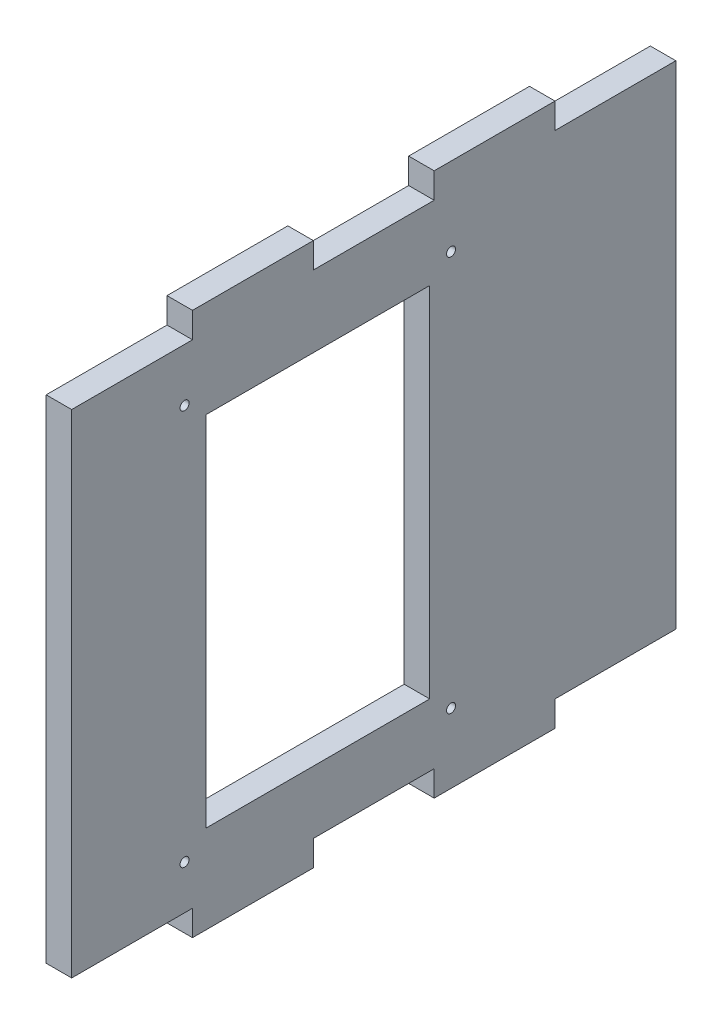
ISO-10303-21;
HEADER;
FILE_DESCRIPTION(('STEP AP214'),'2;1');
FILE_NAME('part.step','',(''),(''),'','','');
FILE_SCHEMA(('AUTOMOTIVE_DESIGN { 1 0 10303 214 1 1 1 1 }'));
ENDSEC;
DATA;
#1=APPLICATION_CONTEXT('core data for automotive mechanical design processes');
#2=APPLICATION_PROTOCOL_DEFINITION('international standard','automotive_design',2000,#1);
#3=PRODUCT_CONTEXT('',#1,'mechanical');
#4=PRODUCT('Part','Part','',(#3));
#5=PRODUCT_RELATED_PRODUCT_CATEGORY('part','',(#4));
#6=PRODUCT_DEFINITION_FORMATION('','',#4);
#7=PRODUCT_DEFINITION_CONTEXT('part definition',#1,'design');
#8=PRODUCT_DEFINITION('design','',#6,#7);
#9=PRODUCT_DEFINITION_SHAPE('','',#8);
#10=(LENGTH_UNIT() NAMED_UNIT(*) SI_UNIT(.MILLI.,.METRE.));
#11=(NAMED_UNIT(*) PLANE_ANGLE_UNIT() SI_UNIT($,.RADIAN.));
#12=(NAMED_UNIT(*) SI_UNIT($,.STERADIAN.) SOLID_ANGLE_UNIT());
#13=UNCERTAINTY_MEASURE_WITH_UNIT(LENGTH_MEASURE(1.E-05),#10,'distance_accuracy_value','');
#14=(GEOMETRIC_REPRESENTATION_CONTEXT(3) GLOBAL_UNCERTAINTY_ASSIGNED_CONTEXT((#13)) GLOBAL_UNIT_ASSIGNED_CONTEXT((#10,
#11,#12)) REPRESENTATION_CONTEXT('',''));
#15=CARTESIAN_POINT('',(0.,0.,0.));
#16=DIRECTION('',(0.,0.,1.));
#17=DIRECTION('',(1.,0.,0.));
#18=AXIS2_PLACEMENT_3D('',#15,#16,#17);
#19=CARTESIAN_POINT('',(5.7,0.,0.));
#20=DIRECTION('',(-1.,0.,0.));
#21=DIRECTION('',(0.,0.,1.));
#22=AXIS2_PLACEMENT_3D('',#19,#20,#21);
#23=PLANE('',#22);
#24=CARTESIAN_POINT('',(5.7,15.83,-84.77));
#25=DIRECTION('',(-1.,0.,0.));
#26=DIRECTION('',(0.,0.,1.));
#27=AXIS2_PLACEMENT_3D('',#24,#25,#26);
#28=CIRCLE('',#27,0.999999999999998);
#29=CARTESIAN_POINT('',(5.7,15.83,-83.77));
#30=VERTEX_POINT('',#29);
#31=EDGE_CURVE('E730',#30,#30,#28,.F.);
#32=ORIENTED_EDGE('',*,*,#31,.F.);
#33=EDGE_LOOP('',(#32));
#34=FACE_BOUND('',#33,.T.);
#35=CARTESIAN_POINT('',(5.7,15.83,-25.23));
#36=DIRECTION('',(-1.,0.,0.));
#37=DIRECTION('',(0.,0.,1.));
#38=AXIS2_PLACEMENT_3D('',#35,#36,#37);
#39=CIRCLE('',#38,1.);
#40=CARTESIAN_POINT('',(5.7,15.83,-24.23));
#41=VERTEX_POINT('',#40);
#42=EDGE_CURVE('E734',#41,#41,#39,.F.);
#43=ORIENTED_EDGE('',*,*,#42,.F.);
#44=EDGE_LOOP('',(#43));
#45=FACE_BOUND('',#44,.T.);
#46=CARTESIAN_POINT('',(5.7,104.17,-84.77));
#47=DIRECTION('',(-1.,0.,0.));
#48=DIRECTION('',(0.,0.,1.));
#49=AXIS2_PLACEMENT_3D('',#46,#47,#48);
#50=CIRCLE('',#49,0.999999999999998);
#51=CARTESIAN_POINT('',(5.7,104.17,-83.77));
#52=VERTEX_POINT('',#51);
#53=EDGE_CURVE('E743',#52,#52,#50,.F.);
#54=ORIENTED_EDGE('',*,*,#53,.F.);
#55=EDGE_LOOP('',(#54));
#56=FACE_BOUND('',#55,.T.);
#57=CARTESIAN_POINT('',(5.7,104.17,-25.23));
#58=DIRECTION('',(-1.,0.,0.));
#59=DIRECTION('',(0.,0.,1.));
#60=AXIS2_PLACEMENT_3D('',#57,#58,#59);
#61=CIRCLE('',#60,1.);
#62=CARTESIAN_POINT('',(5.7,104.17,-24.23));
#63=VERTEX_POINT('',#62);
#64=EDGE_CURVE('E216',#63,#63,#61,.F.);
#65=ORIENTED_EDGE('',*,*,#64,.F.);
#66=EDGE_LOOP('',(#65));
#67=FACE_BOUND('',#66,.T.);
#68=DIRECTION('',(0.,0.,1.));
#69=VECTOR('',#68,1.);
#70=CARTESIAN_POINT('',(5.7,5.99999999999999,0.));
#71=LINE('',#70,#69);
#72=CARTESIAN_POINT('',(5.7,5.99999999999999,-135.));
#73=VERTEX_POINT('',#72);
#74=CARTESIAN_POINT('',(5.7,5.99999999999999,-108.));
#75=VERTEX_POINT('',#74);
#76=EDGE_CURVE('E299',#73,#75,#71,.T.);
#77=ORIENTED_EDGE('',*,*,#76,.F.);
#78=DIRECTION('',(0.,1.,0.));
#79=VECTOR('',#78,1.);
#80=CARTESIAN_POINT('',(5.7,0.,-135.));
#81=LINE('',#80,#79);
#82=CARTESIAN_POINT('',(5.7,116.,-135.));
#83=VERTEX_POINT('',#82);
#84=EDGE_CURVE('E11',#73,#83,#81,.T.);
#85=ORIENTED_EDGE('',*,*,#84,.T.);
#86=DIRECTION('',(0.,0.,-1.));
#87=VECTOR('',#86,1.);
#88=CARTESIAN_POINT('',(5.7,116.,0.));
#89=LINE('',#88,#87);
#90=CARTESIAN_POINT('',(5.7,116.,-108.));
#91=VERTEX_POINT('',#90);
#92=EDGE_CURVE('E350',#91,#83,#89,.T.);
#93=ORIENTED_EDGE('',*,*,#92,.F.);
#94=DIRECTION('',(0.,-1.,0.));
#95=VECTOR('',#94,1.);
#96=CARTESIAN_POINT('',(5.7,0.,-108.));
#97=LINE('',#96,#95);
#98=CARTESIAN_POINT('',(5.7,121.7,-108.));
#99=VERTEX_POINT('',#98);
#100=EDGE_CURVE('E353',#99,#91,#97,.T.);
#101=ORIENTED_EDGE('',*,*,#100,.F.);
#102=DIRECTION('',(0.,0.,-1.));
#103=VECTOR('',#102,1.);
#104=CARTESIAN_POINT('',(5.7,121.7,0.));
#105=LINE('',#104,#103);
#106=CARTESIAN_POINT('',(5.7,121.7,-81.));
#107=VERTEX_POINT('',#106);
#108=EDGE_CURVE('E355',#107,#99,#105,.T.);
#109=ORIENTED_EDGE('',*,*,#108,.F.);
#110=DIRECTION('',(0.,1.,0.));
#111=VECTOR('',#110,1.);
#112=CARTESIAN_POINT('',(5.7,0.,-81.));
#113=LINE('',#112,#111);
#114=CARTESIAN_POINT('',(5.7,116.,-81.));
#115=VERTEX_POINT('',#114);
#116=EDGE_CURVE('E357',#115,#107,#113,.T.);
#117=ORIENTED_EDGE('',*,*,#116,.F.);
#118=DIRECTION('',(0.,0.,-1.));
#119=VECTOR('',#118,1.);
#120=CARTESIAN_POINT('',(5.7,116.,0.));
#121=LINE('',#120,#119);
#122=CARTESIAN_POINT('',(5.7,116.,-54.));
#123=VERTEX_POINT('',#122);
#124=EDGE_CURVE('E359',#123,#115,#121,.T.);
#125=ORIENTED_EDGE('',*,*,#124,.F.);
#126=DIRECTION('',(0.,-1.,0.));
#127=VECTOR('',#126,1.);
#128=CARTESIAN_POINT('',(5.7,0.,-54.));
#129=LINE('',#128,#127);
#130=CARTESIAN_POINT('',(5.7,121.7,-54.));
#131=VERTEX_POINT('',#130);
#132=EDGE_CURVE('E361',#131,#123,#129,.T.);
#133=ORIENTED_EDGE('',*,*,#132,.F.);
#134=DIRECTION('',(0.,0.,-1.));
#135=VECTOR('',#134,1.);
#136=CARTESIAN_POINT('',(5.7,121.7,0.));
#137=LINE('',#136,#135);
#138=CARTESIAN_POINT('',(5.7,121.7,-27.));
#139=VERTEX_POINT('',#138);
#140=EDGE_CURVE('E363',#139,#131,#137,.T.);
#141=ORIENTED_EDGE('',*,*,#140,.F.);
#142=DIRECTION('',(0.,1.,0.));
#143=VECTOR('',#142,1.);
#144=CARTESIAN_POINT('',(5.7,0.,-27.));
#145=LINE('',#144,#143);
#146=CARTESIAN_POINT('',(5.7,116.,-27.));
#147=VERTEX_POINT('',#146);
#148=EDGE_CURVE('E365',#147,#139,#145,.T.);
#149=ORIENTED_EDGE('',*,*,#148,.F.);
#150=DIRECTION('',(0.,0.,-1.));
#151=VECTOR('',#150,1.);
#152=CARTESIAN_POINT('',(5.7,116.,0.));
#153=LINE('',#152,#151);
#154=CARTESIAN_POINT('',(5.7,116.,0.));
#155=VERTEX_POINT('',#154);
#156=EDGE_CURVE('E367',#155,#147,#153,.T.);
#157=ORIENTED_EDGE('',*,*,#156,.F.);
#158=DIRECTION('',(0.,-1.,0.));
#159=VECTOR('',#158,1.);
#160=CARTESIAN_POINT('',(5.7,0.,0.));
#161=LINE('',#160,#159);
#162=CARTESIAN_POINT('',(5.7,5.99999999999999,0.));
#163=VERTEX_POINT('',#162);
#164=EDGE_CURVE('E42',#155,#163,#161,.T.);
#165=ORIENTED_EDGE('',*,*,#164,.T.);
#166=DIRECTION('',(0.,0.,1.));
#167=VECTOR('',#166,1.);
#168=CARTESIAN_POINT('',(5.7,5.99999999999999,0.));
#169=LINE('',#168,#167);
#170=CARTESIAN_POINT('',(5.7,5.99999999999999,-27.));
#171=VERTEX_POINT('',#170);
#172=EDGE_CURVE('E283',#171,#163,#169,.T.);
#173=ORIENTED_EDGE('',*,*,#172,.F.);
#174=DIRECTION('',(0.,1.,0.));
#175=VECTOR('',#174,1.);
#176=CARTESIAN_POINT('',(5.7,0.,-27.));
#177=LINE('',#176,#175);
#178=CARTESIAN_POINT('',(5.7,0.299999999999991,-27.));
#179=VERTEX_POINT('',#178);
#180=EDGE_CURVE('E285',#179,#171,#177,.T.);
#181=ORIENTED_EDGE('',*,*,#180,.F.);
#182=DIRECTION('',(0.,0.,1.));
#183=VECTOR('',#182,1.);
#184=CARTESIAN_POINT('',(5.7,0.299999999999991,0.));
#185=LINE('',#184,#183);
#186=CARTESIAN_POINT('',(5.7,0.299999999999991,-54.));
#187=VERTEX_POINT('',#186);
#188=EDGE_CURVE('E287',#187,#179,#185,.T.);
#189=ORIENTED_EDGE('',*,*,#188,.F.);
#190=DIRECTION('',(0.,-1.,0.));
#191=VECTOR('',#190,1.);
#192=CARTESIAN_POINT('',(5.7,0.,-54.));
#193=LINE('',#192,#191);
#194=CARTESIAN_POINT('',(5.7,5.99999999999999,-54.));
#195=VERTEX_POINT('',#194);
#196=EDGE_CURVE('E289',#195,#187,#193,.T.);
#197=ORIENTED_EDGE('',*,*,#196,.F.);
#198=DIRECTION('',(0.,0.,1.));
#199=VECTOR('',#198,1.);
#200=CARTESIAN_POINT('',(5.7,5.99999999999999,0.));
#201=LINE('',#200,#199);
#202=CARTESIAN_POINT('',(5.7,5.99999999999999,-81.));
#203=VERTEX_POINT('',#202);
#204=EDGE_CURVE('E291',#203,#195,#201,.T.);
#205=ORIENTED_EDGE('',*,*,#204,.F.);
#206=DIRECTION('',(0.,1.,0.));
#207=VECTOR('',#206,1.);
#208=CARTESIAN_POINT('',(5.7,0.,-81.));
#209=LINE('',#208,#207);
#210=CARTESIAN_POINT('',(5.7,0.299999999999991,-81.));
#211=VERTEX_POINT('',#210);
#212=EDGE_CURVE('E293',#211,#203,#209,.T.);
#213=ORIENTED_EDGE('',*,*,#212,.F.);
#214=DIRECTION('',(0.,0.,1.));
#215=VECTOR('',#214,1.);
#216=CARTESIAN_POINT('',(5.7,0.299999999999991,0.));
#217=LINE('',#216,#215);
#218=CARTESIAN_POINT('',(5.7,0.299999999999991,-108.));
#219=VERTEX_POINT('',#218);
#220=EDGE_CURVE('E295',#219,#211,#217,.T.);
#221=ORIENTED_EDGE('',*,*,#220,.F.);
#222=DIRECTION('',(0.,-1.,0.));
#223=VECTOR('',#222,1.);
#224=CARTESIAN_POINT('',(5.7,0.,-108.));
#225=LINE('',#224,#223);
#226=EDGE_CURVE('E297',#75,#219,#225,.T.);
#227=ORIENTED_EDGE('',*,*,#226,.F.);
#228=EDGE_LOOP('',(#77,#85,#93,#101,#109,#117,#125,#133,#141,#149,#157,#165,#173,#181,#189,#197,
#205,#213,#221,#227));
#229=FACE_BOUND('',#228,.T.);
#230=DIRECTION('',(0.,-1.,0.));
#231=VECTOR('',#230,1.);
#232=CARTESIAN_POINT('',(5.7,0.,-30.));
#233=LINE('',#232,#231);
#234=CARTESIAN_POINT('',(5.7,100.,-30.));
#235=VERTEX_POINT('',#234);
#236=CARTESIAN_POINT('',(5.7,20.,-30.));
#237=VERTEX_POINT('',#236);
#238=EDGE_CURVE('E198',#235,#237,#233,.T.);
#239=ORIENTED_EDGE('',*,*,#238,.F.);
#240=DIRECTION('',(0.,0.,1.));
#241=VECTOR('',#240,1.);
#242=CARTESIAN_POINT('',(5.7,100.,0.));
#243=LINE('',#242,#241);
#244=CARTESIAN_POINT('',(5.7,100.,-80.));
#245=VERTEX_POINT('',#244);
#246=EDGE_CURVE('E201',#245,#235,#243,.T.);
#247=ORIENTED_EDGE('',*,*,#246,.F.);
#248=DIRECTION('',(0.,1.,0.));
#249=VECTOR('',#248,1.);
#250=CARTESIAN_POINT('',(5.7,0.,-80.));
#251=LINE('',#250,#249);
#252=CARTESIAN_POINT('',(5.7,20.,-80.));
#253=VERTEX_POINT('',#252);
#254=EDGE_CURVE('E230',#253,#245,#251,.T.);
#255=ORIENTED_EDGE('',*,*,#254,.F.);
#256=DIRECTION('',(0.,0.,-1.));
#257=VECTOR('',#256,1.);
#258=CARTESIAN_POINT('',(5.7,20.,0.));
#259=LINE('',#258,#257);
#260=EDGE_CURVE('E232',#237,#253,#259,.T.);
#261=ORIENTED_EDGE('',*,*,#260,.F.);
#262=EDGE_LOOP('',(#239,#247,#255,#261));
#263=FACE_BOUND('',#262,.T.);
#264=ADVANCED_FACE('F33',(#34,#45,#56,#67,#229,#263),#23,.F.);
#265=CARTESIAN_POINT('',(0.,0.,0.));
#266=DIRECTION('',(-1.,0.,0.));
#267=DIRECTION('',(0.,0.,1.));
#268=AXIS2_PLACEMENT_3D('',#265,#266,#267);
#269=PLANE('',#268);
#270=CARTESIAN_POINT('',(0.,15.83,-84.77));
#271=DIRECTION('',(1.,0.,0.));
#272=DIRECTION('',(0.,0.,-1.));
#273=AXIS2_PLACEMENT_3D('',#270,#271,#272);
#274=CIRCLE('',#273,0.999999999999998);
#275=CARTESIAN_POINT('',(0.,15.83,-85.77));
#276=VERTEX_POINT('',#275);
#277=EDGE_CURVE('E728',#276,#276,#274,.T.);
#278=ORIENTED_EDGE('',*,*,#277,.T.);
#279=EDGE_LOOP('',(#278));
#280=FACE_BOUND('',#279,.T.);
#281=CARTESIAN_POINT('',(0.,15.83,-25.23));
#282=DIRECTION('',(1.,0.,0.));
#283=DIRECTION('',(0.,0.,-1.));
#284=AXIS2_PLACEMENT_3D('',#281,#282,#283);
#285=CIRCLE('',#284,1.);
#286=CARTESIAN_POINT('',(0.,15.83,-26.23));
#287=VERTEX_POINT('',#286);
#288=EDGE_CURVE('E731',#287,#287,#285,.T.);
#289=ORIENTED_EDGE('',*,*,#288,.T.);
#290=EDGE_LOOP('',(#289));
#291=FACE_BOUND('',#290,.T.);
#292=CARTESIAN_POINT('',(0.,104.17,-84.77));
#293=DIRECTION('',(1.,0.,0.));
#294=DIRECTION('',(0.,0.,-1.));
#295=AXIS2_PLACEMENT_3D('',#292,#293,#294);
#296=CIRCLE('',#295,0.999999999999998);
#297=CARTESIAN_POINT('',(0.,104.17,-85.77));
#298=VERTEX_POINT('',#297);
#299=EDGE_CURVE('E740',#298,#298,#296,.T.);
#300=ORIENTED_EDGE('',*,*,#299,.T.);
#301=EDGE_LOOP('',(#300));
#302=FACE_BOUND('',#301,.T.);
#303=CARTESIAN_POINT('',(0.,104.17,-25.23));
#304=DIRECTION('',(1.,0.,0.));
#305=DIRECTION('',(0.,0.,-1.));
#306=AXIS2_PLACEMENT_3D('',#303,#304,#305);
#307=CIRCLE('',#306,1.);
#308=CARTESIAN_POINT('',(0.,104.17,-26.23));
#309=VERTEX_POINT('',#308);
#310=EDGE_CURVE('E219',#309,#309,#307,.T.);
#311=ORIENTED_EDGE('',*,*,#310,.T.);
#312=EDGE_LOOP('',(#311));
#313=FACE_BOUND('',#312,.T.);
#314=DIRECTION('',(0.,1.,0.));
#315=VECTOR('',#314,1.);
#316=CARTESIAN_POINT('',(0.,0.,-135.));
#317=LINE('',#316,#315);
#318=CARTESIAN_POINT('',(0.,5.99999999999999,-135.));
#319=VERTEX_POINT('',#318);
#320=CARTESIAN_POINT('',(0.,116.,-135.));
#321=VERTEX_POINT('',#320);
#322=EDGE_CURVE('E37',#319,#321,#317,.T.);
#323=ORIENTED_EDGE('',*,*,#322,.F.);
#324=DIRECTION('',(0.,0.,1.));
#325=VECTOR('',#324,1.);
#326=CARTESIAN_POINT('',(0.,5.99999999999999,-108.));
#327=LINE('',#326,#325);
#328=CARTESIAN_POINT('',(0.,5.99999999999999,-108.));
#329=VERTEX_POINT('',#328);
#330=EDGE_CURVE('E235',#319,#329,#327,.T.);
#331=ORIENTED_EDGE('',*,*,#330,.T.);
#332=DIRECTION('',(0.,-1.,0.));
#333=VECTOR('',#332,1.);
#334=CARTESIAN_POINT('',(0.,0.299999999999991,-108.));
#335=LINE('',#334,#333);
#336=CARTESIAN_POINT('',(0.,0.299999999999991,-108.));
#337=VERTEX_POINT('',#336);
#338=EDGE_CURVE('E238',#329,#337,#335,.T.);
#339=ORIENTED_EDGE('',*,*,#338,.T.);
#340=DIRECTION('',(0.,0.,1.));
#341=VECTOR('',#340,1.);
#342=CARTESIAN_POINT('',(0.,0.299999999999991,-81.));
#343=LINE('',#342,#341);
#344=CARTESIAN_POINT('',(0.,0.299999999999991,-81.));
#345=VERTEX_POINT('',#344);
#346=EDGE_CURVE('E241',#337,#345,#343,.T.);
#347=ORIENTED_EDGE('',*,*,#346,.T.);
#348=DIRECTION('',(0.,1.,0.));
#349=VECTOR('',#348,1.);
#350=CARTESIAN_POINT('',(0.,5.99999999999999,-81.));
#351=LINE('',#350,#349);
#352=CARTESIAN_POINT('',(0.,5.99999999999999,-81.));
#353=VERTEX_POINT('',#352);
#354=EDGE_CURVE('E244',#345,#353,#351,.T.);
#355=ORIENTED_EDGE('',*,*,#354,.T.);
#356=DIRECTION('',(0.,0.,1.));
#357=VECTOR('',#356,1.);
#358=CARTESIAN_POINT('',(0.,5.99999999999999,-54.));
#359=LINE('',#358,#357);
#360=CARTESIAN_POINT('',(0.,5.99999999999999,-54.));
#361=VERTEX_POINT('',#360);
#362=EDGE_CURVE('E247',#353,#361,#359,.T.);
#363=ORIENTED_EDGE('',*,*,#362,.T.);
#364=DIRECTION('',(0.,-1.,0.));
#365=VECTOR('',#364,1.);
#366=CARTESIAN_POINT('',(0.,0.299999999999991,-54.));
#367=LINE('',#366,#365);
#368=CARTESIAN_POINT('',(0.,0.299999999999991,-54.));
#369=VERTEX_POINT('',#368);
#370=EDGE_CURVE('E250',#361,#369,#367,.T.);
#371=ORIENTED_EDGE('',*,*,#370,.T.);
#372=DIRECTION('',(0.,0.,1.));
#373=VECTOR('',#372,1.);
#374=CARTESIAN_POINT('',(0.,0.299999999999991,-27.));
#375=LINE('',#374,#373);
#376=CARTESIAN_POINT('',(0.,0.299999999999991,-27.));
#377=VERTEX_POINT('',#376);
#378=EDGE_CURVE('E253',#369,#377,#375,.T.);
#379=ORIENTED_EDGE('',*,*,#378,.T.);
#380=DIRECTION('',(0.,1.,0.));
#381=VECTOR('',#380,1.);
#382=CARTESIAN_POINT('',(0.,5.99999999999999,-27.));
#383=LINE('',#382,#381);
#384=CARTESIAN_POINT('',(0.,5.99999999999999,-27.));
#385=VERTEX_POINT('',#384);
#386=EDGE_CURVE('E256',#377,#385,#383,.T.);
#387=ORIENTED_EDGE('',*,*,#386,.T.);
#388=DIRECTION('',(0.,0.,1.));
#389=VECTOR('',#388,1.);
#390=CARTESIAN_POINT('',(0.,5.99999999999999,0.));
#391=LINE('',#390,#389);
#392=CARTESIAN_POINT('',(0.,5.99999999999999,0.));
#393=VERTEX_POINT('',#392);
#394=EDGE_CURVE('E259',#385,#393,#391,.T.);
#395=ORIENTED_EDGE('',*,*,#394,.T.);
#396=DIRECTION('',(0.,-1.,0.));
#397=VECTOR('',#396,1.);
#398=CARTESIAN_POINT('',(0.,0.,0.));
#399=LINE('',#398,#397);
#400=CARTESIAN_POINT('',(0.,116.,0.));
#401=VERTEX_POINT('',#400);
#402=EDGE_CURVE('E369',#401,#393,#399,.T.);
#403=ORIENTED_EDGE('',*,*,#402,.F.);
#404=DIRECTION('',(0.,0.,-1.));
#405=VECTOR('',#404,1.);
#406=CARTESIAN_POINT('',(0.,116.,0.));
#407=LINE('',#406,#405);
#408=CARTESIAN_POINT('',(0.,116.,-27.));
#409=VERTEX_POINT('',#408);
#410=EDGE_CURVE('E301',#401,#409,#407,.T.);
#411=ORIENTED_EDGE('',*,*,#410,.T.);
#412=DIRECTION('',(0.,1.,0.));
#413=VECTOR('',#412,1.);
#414=CARTESIAN_POINT('',(0.,116.,-27.));
#415=LINE('',#414,#413);
#416=CARTESIAN_POINT('',(0.,121.7,-27.));
#417=VERTEX_POINT('',#416);
#418=EDGE_CURVE('E304',#409,#417,#415,.T.);
#419=ORIENTED_EDGE('',*,*,#418,.T.);
#420=DIRECTION('',(0.,0.,-1.));
#421=VECTOR('',#420,1.);
#422=CARTESIAN_POINT('',(0.,121.7,-27.));
#423=LINE('',#422,#421);
#424=CARTESIAN_POINT('',(0.,121.7,-54.));
#425=VERTEX_POINT('',#424);
#426=EDGE_CURVE('E307',#417,#425,#423,.T.);
#427=ORIENTED_EDGE('',*,*,#426,.T.);
#428=DIRECTION('',(0.,-1.,0.));
#429=VECTOR('',#428,1.);
#430=CARTESIAN_POINT('',(0.,121.7,-54.));
#431=LINE('',#430,#429);
#432=CARTESIAN_POINT('',(0.,116.,-54.));
#433=VERTEX_POINT('',#432);
#434=EDGE_CURVE('E310',#425,#433,#431,.T.);
#435=ORIENTED_EDGE('',*,*,#434,.T.);
#436=DIRECTION('',(0.,0.,-1.));
#437=VECTOR('',#436,1.);
#438=CARTESIAN_POINT('',(0.,116.,-54.));
#439=LINE('',#438,#437);
#440=CARTESIAN_POINT('',(0.,116.,-81.));
#441=VERTEX_POINT('',#440);
#442=EDGE_CURVE('E313',#433,#441,#439,.T.);
#443=ORIENTED_EDGE('',*,*,#442,.T.);
#444=DIRECTION('',(0.,1.,0.));
#445=VECTOR('',#444,1.);
#446=CARTESIAN_POINT('',(0.,116.,-81.));
#447=LINE('',#446,#445);
#448=CARTESIAN_POINT('',(0.,121.7,-81.));
#449=VERTEX_POINT('',#448);
#450=EDGE_CURVE('E316',#441,#449,#447,.T.);
#451=ORIENTED_EDGE('',*,*,#450,.T.);
#452=DIRECTION('',(0.,0.,-1.));
#453=VECTOR('',#452,1.);
#454=CARTESIAN_POINT('',(0.,121.7,-81.));
#455=LINE('',#454,#453);
#456=CARTESIAN_POINT('',(0.,121.7,-108.));
#457=VERTEX_POINT('',#456);
#458=EDGE_CURVE('E319',#449,#457,#455,.T.);
#459=ORIENTED_EDGE('',*,*,#458,.T.);
#460=DIRECTION('',(0.,-1.,0.));
#461=VECTOR('',#460,1.);
#462=CARTESIAN_POINT('',(0.,121.7,-108.));
#463=LINE('',#462,#461);
#464=CARTESIAN_POINT('',(0.,116.,-108.));
#465=VERTEX_POINT('',#464);
#466=EDGE_CURVE('E322',#457,#465,#463,.T.);
#467=ORIENTED_EDGE('',*,*,#466,.T.);
#468=DIRECTION('',(0.,0.,-1.));
#469=VECTOR('',#468,1.);
#470=CARTESIAN_POINT('',(0.,116.,-108.));
#471=LINE('',#470,#469);
#472=EDGE_CURVE('E325',#465,#321,#471,.T.);
#473=ORIENTED_EDGE('',*,*,#472,.T.);
#474=EDGE_LOOP('',(#323,#331,#339,#347,#355,#363,#371,#379,#387,#395,#403,#411,#419,#427,#435,
#443,#451,#459,#467,#473));
#475=FACE_BOUND('',#474,.T.);
#476=DIRECTION('',(0.,0.,1.));
#477=VECTOR('',#476,1.);
#478=CARTESIAN_POINT('',(0.,100.,-30.));
#479=LINE('',#478,#477);
#480=CARTESIAN_POINT('',(0.,100.,-80.));
#481=VERTEX_POINT('',#480);
#482=CARTESIAN_POINT('',(0.,100.,-30.));
#483=VERTEX_POINT('',#482);
#484=EDGE_CURVE('E215',#481,#483,#479,.T.);
#485=ORIENTED_EDGE('',*,*,#484,.T.);
#486=DIRECTION('',(0.,-1.,0.));
#487=VECTOR('',#486,1.);
#488=CARTESIAN_POINT('',(0.,100.,-30.));
#489=LINE('',#488,#487);
#490=CARTESIAN_POINT('',(0.,20.,-30.));
#491=VERTEX_POINT('',#490);
#492=EDGE_CURVE('E58',#483,#491,#489,.T.);
#493=ORIENTED_EDGE('',*,*,#492,.T.);
#494=DIRECTION('',(0.,0.,-1.));
#495=VECTOR('',#494,1.);
#496=CARTESIAN_POINT('',(0.,20.,-30.));
#497=LINE('',#496,#495);
#498=CARTESIAN_POINT('',(0.,20.,-80.));
#499=VERTEX_POINT('',#498);
#500=EDGE_CURVE('E205',#491,#499,#497,.T.);
#501=ORIENTED_EDGE('',*,*,#500,.T.);
#502=DIRECTION('',(0.,1.,0.));
#503=VECTOR('',#502,1.);
#504=CARTESIAN_POINT('',(0.,100.,-80.));
#505=LINE('',#504,#503);
#506=EDGE_CURVE('E211',#499,#481,#505,.T.);
#507=ORIENTED_EDGE('',*,*,#506,.T.);
#508=EDGE_LOOP('',(#485,#493,#501,#507));
#509=FACE_BOUND('',#508,.T.);
#510=ADVANCED_FACE('F214',(#280,#291,#302,#313,#475,#509),#269,.T.);
#511=CARTESIAN_POINT('',(5.7,0.,0.));
#512=DIRECTION('',(0.,0.,-1.));
#513=DIRECTION('',(-1.,0.,0.));
#514=AXIS2_PLACEMENT_3D('',#511,#512,#513);
#515=PLANE('',#514);
#516=DIRECTION('',(-1.,0.,0.));
#517=VECTOR('',#516,1.);
#518=CARTESIAN_POINT('',(6.,5.99999999999999,0.));
#519=LINE('',#518,#517);
#520=EDGE_CURVE('E262',#163,#393,#519,.T.);
#521=ORIENTED_EDGE('',*,*,#520,.F.);
#522=ORIENTED_EDGE('',*,*,#164,.F.);
#523=DIRECTION('',(-1.,0.,0.));
#524=VECTOR('',#523,1.);
#525=CARTESIAN_POINT('',(6.,116.,0.));
#526=LINE('',#525,#524);
#527=EDGE_CURVE('E347',#155,#401,#526,.T.);
#528=ORIENTED_EDGE('',*,*,#527,.T.);
#529=ORIENTED_EDGE('',*,*,#402,.T.);
#530=EDGE_LOOP('',(#521,#522,#528,#529));
#531=FACE_BOUND('',#530,.T.);
#532=ADVANCED_FACE('F35',(#531),#515,.F.);
#533=CARTESIAN_POINT('',(5.7,0.,-135.));
#534=DIRECTION('',(0.,0.,1.));
#535=DIRECTION('',(1.,0.,0.));
#536=AXIS2_PLACEMENT_3D('',#533,#534,#535);
#537=PLANE('',#536);
#538=DIRECTION('',(-1.,0.,0.));
#539=VECTOR('',#538,1.);
#540=CARTESIAN_POINT('',(6.,5.99999999999999,-135.));
#541=LINE('',#540,#539);
#542=EDGE_CURVE('E280',#73,#319,#541,.T.);
#543=ORIENTED_EDGE('',*,*,#542,.T.);
#544=ORIENTED_EDGE('',*,*,#322,.T.);
#545=DIRECTION('',(-1.,0.,0.));
#546=VECTOR('',#545,1.);
#547=CARTESIAN_POINT('',(6.,116.,-135.));
#548=LINE('',#547,#546);
#549=EDGE_CURVE('E328',#83,#321,#548,.T.);
#550=ORIENTED_EDGE('',*,*,#549,.F.);
#551=ORIENTED_EDGE('',*,*,#84,.F.);
#552=EDGE_LOOP('',(#543,#544,#550,#551));
#553=FACE_BOUND('',#552,.T.);
#554=ADVANCED_FACE('F378',(#553),#537,.F.);
#555=CARTESIAN_POINT('',(6.,116.,0.));
#556=DIRECTION('',(0.,1.,0.));
#557=DIRECTION('',(0.,0.,1.));
#558=AXIS2_PLACEMENT_3D('',#555,#556,#557);
#559=PLANE('',#558);
#560=ORIENTED_EDGE('',*,*,#156,.T.);
#561=DIRECTION('',(-1.,0.,0.));
#562=VECTOR('',#561,1.);
#563=CARTESIAN_POINT('',(6.,116.,-27.));
#564=LINE('',#563,#562);
#565=EDGE_CURVE('E345',#147,#409,#564,.T.);
#566=ORIENTED_EDGE('',*,*,#565,.T.);
#567=ORIENTED_EDGE('',*,*,#410,.F.);
#568=ORIENTED_EDGE('',*,*,#527,.F.);
#569=EDGE_LOOP('',(#560,#566,#567,#568));
#570=FACE_BOUND('',#569,.T.);
#571=ADVANCED_FACE('F444',(#570),#559,.T.);
#572=CARTESIAN_POINT('',(6.,116.,-27.));
#573=DIRECTION('',(0.,0.,1.));
#574=DIRECTION('',(1.,0.,0.));
#575=AXIS2_PLACEMENT_3D('',#572,#573,#574);
#576=PLANE('',#575);
#577=ORIENTED_EDGE('',*,*,#148,.T.);
#578=DIRECTION('',(-1.,0.,0.));
#579=VECTOR('',#578,1.);
#580=CARTESIAN_POINT('',(6.,121.7,-27.));
#581=LINE('',#580,#579);
#582=EDGE_CURVE('E343',#139,#417,#581,.T.);
#583=ORIENTED_EDGE('',*,*,#582,.T.);
#584=ORIENTED_EDGE('',*,*,#418,.F.);
#585=ORIENTED_EDGE('',*,*,#565,.F.);
#586=EDGE_LOOP('',(#577,#583,#584,#585));
#587=FACE_BOUND('',#586,.T.);
#588=ADVANCED_FACE('F447',(#587),#576,.T.);
#589=CARTESIAN_POINT('',(6.,121.7,-27.));
#590=DIRECTION('',(0.,1.,0.));
#591=DIRECTION('',(0.,0.,1.));
#592=AXIS2_PLACEMENT_3D('',#589,#590,#591);
#593=PLANE('',#592);
#594=ORIENTED_EDGE('',*,*,#140,.T.);
#595=DIRECTION('',(-1.,0.,0.));
#596=VECTOR('',#595,1.);
#597=CARTESIAN_POINT('',(6.,121.7,-54.));
#598=LINE('',#597,#596);
#599=EDGE_CURVE('E341',#131,#425,#598,.T.);
#600=ORIENTED_EDGE('',*,*,#599,.T.);
#601=ORIENTED_EDGE('',*,*,#426,.F.);
#602=ORIENTED_EDGE('',*,*,#582,.F.);
#603=EDGE_LOOP('',(#594,#600,#601,#602));
#604=FACE_BOUND('',#603,.T.);
#605=ADVANCED_FACE('F452',(#604),#593,.T.);
#606=CARTESIAN_POINT('',(6.,121.7,-54.));
#607=DIRECTION('',(0.,0.,-1.));
#608=DIRECTION('',(-1.,0.,0.));
#609=AXIS2_PLACEMENT_3D('',#606,#607,#608);
#610=PLANE('',#609);
#611=ORIENTED_EDGE('',*,*,#132,.T.);
#612=DIRECTION('',(-1.,0.,0.));
#613=VECTOR('',#612,1.);
#614=CARTESIAN_POINT('',(6.,116.,-54.));
#615=LINE('',#614,#613);
#616=EDGE_CURVE('E339',#123,#433,#615,.T.);
#617=ORIENTED_EDGE('',*,*,#616,.T.);
#618=ORIENTED_EDGE('',*,*,#434,.F.);
#619=ORIENTED_EDGE('',*,*,#599,.F.);
#620=EDGE_LOOP('',(#611,#617,#618,#619));
#621=FACE_BOUND('',#620,.T.);
#622=ADVANCED_FACE('F456',(#621),#610,.T.);
#623=CARTESIAN_POINT('',(6.,116.,-54.));
#624=DIRECTION('',(0.,1.,0.));
#625=DIRECTION('',(0.,0.,1.));
#626=AXIS2_PLACEMENT_3D('',#623,#624,#625);
#627=PLANE('',#626);
#628=ORIENTED_EDGE('',*,*,#124,.T.);
#629=DIRECTION('',(-1.,0.,0.));
#630=VECTOR('',#629,1.);
#631=CARTESIAN_POINT('',(6.,116.,-81.));
#632=LINE('',#631,#630);
#633=EDGE_CURVE('E337',#115,#441,#632,.T.);
#634=ORIENTED_EDGE('',*,*,#633,.T.);
#635=ORIENTED_EDGE('',*,*,#442,.F.);
#636=ORIENTED_EDGE('',*,*,#616,.F.);
#637=EDGE_LOOP('',(#628,#634,#635,#636));
#638=FACE_BOUND('',#637,.T.);
#639=ADVANCED_FACE('F461',(#638),#627,.T.);
#640=CARTESIAN_POINT('',(6.,116.,-81.));
#641=DIRECTION('',(0.,0.,1.));
#642=DIRECTION('',(1.,0.,0.));
#643=AXIS2_PLACEMENT_3D('',#640,#641,#642);
#644=PLANE('',#643);
#645=ORIENTED_EDGE('',*,*,#116,.T.);
#646=DIRECTION('',(-1.,0.,0.));
#647=VECTOR('',#646,1.);
#648=CARTESIAN_POINT('',(6.,121.7,-81.));
#649=LINE('',#648,#647);
#650=EDGE_CURVE('E335',#107,#449,#649,.T.);
#651=ORIENTED_EDGE('',*,*,#650,.T.);
#652=ORIENTED_EDGE('',*,*,#450,.F.);
#653=ORIENTED_EDGE('',*,*,#633,.F.);
#654=EDGE_LOOP('',(#645,#651,#652,#653));
#655=FACE_BOUND('',#654,.T.);
#656=ADVANCED_FACE('F465',(#655),#644,.T.);
#657=CARTESIAN_POINT('',(6.,121.7,-81.));
#658=DIRECTION('',(0.,1.,0.));
#659=DIRECTION('',(0.,0.,1.));
#660=AXIS2_PLACEMENT_3D('',#657,#658,#659);
#661=PLANE('',#660);
#662=ORIENTED_EDGE('',*,*,#108,.T.);
#663=DIRECTION('',(-1.,0.,0.));
#664=VECTOR('',#663,1.);
#665=CARTESIAN_POINT('',(6.,121.7,-108.));
#666=LINE('',#665,#664);
#667=EDGE_CURVE('E333',#99,#457,#666,.T.);
#668=ORIENTED_EDGE('',*,*,#667,.T.);
#669=ORIENTED_EDGE('',*,*,#458,.F.);
#670=ORIENTED_EDGE('',*,*,#650,.F.);
#671=EDGE_LOOP('',(#662,#668,#669,#670));
#672=FACE_BOUND('',#671,.T.);
#673=ADVANCED_FACE('F469',(#672),#661,.T.);
#674=CARTESIAN_POINT('',(6.,121.7,-108.));
#675=DIRECTION('',(0.,0.,-1.));
#676=DIRECTION('',(-1.,0.,0.));
#677=AXIS2_PLACEMENT_3D('',#674,#675,#676);
#678=PLANE('',#677);
#679=ORIENTED_EDGE('',*,*,#100,.T.);
#680=DIRECTION('',(-1.,0.,0.));
#681=VECTOR('',#680,1.);
#682=CARTESIAN_POINT('',(6.,116.,-108.));
#683=LINE('',#682,#681);
#684=EDGE_CURVE('E331',#91,#465,#683,.T.);
#685=ORIENTED_EDGE('',*,*,#684,.T.);
#686=ORIENTED_EDGE('',*,*,#466,.F.);
#687=ORIENTED_EDGE('',*,*,#667,.F.);
#688=EDGE_LOOP('',(#679,#685,#686,#687));
#689=FACE_BOUND('',#688,.T.);
#690=ADVANCED_FACE('F390',(#689),#678,.T.);
#691=CARTESIAN_POINT('',(6.,116.,-108.));
#692=DIRECTION('',(0.,1.,0.));
#693=DIRECTION('',(0.,0.,1.));
#694=AXIS2_PLACEMENT_3D('',#691,#692,#693);
#695=PLANE('',#694);
#696=ORIENTED_EDGE('',*,*,#92,.T.);
#697=ORIENTED_EDGE('',*,*,#549,.T.);
#698=ORIENTED_EDGE('',*,*,#472,.F.);
#699=ORIENTED_EDGE('',*,*,#684,.F.);
#700=EDGE_LOOP('',(#696,#697,#698,#699));
#701=FACE_BOUND('',#700,.T.);
#702=ADVANCED_FACE('F383',(#701),#695,.T.);
#703=CARTESIAN_POINT('',(6.,5.99999999999999,-108.));
#704=DIRECTION('',(0.,-1.,0.));
#705=DIRECTION('',(0.,0.,-1.));
#706=AXIS2_PLACEMENT_3D('',#703,#704,#705);
#707=PLANE('',#706);
#708=ORIENTED_EDGE('',*,*,#76,.T.);
#709=DIRECTION('',(-1.,0.,0.));
#710=VECTOR('',#709,1.);
#711=CARTESIAN_POINT('',(6.,5.99999999999999,-108.));
#712=LINE('',#711,#710);
#713=EDGE_CURVE('E278',#75,#329,#712,.T.);
#714=ORIENTED_EDGE('',*,*,#713,.T.);
#715=ORIENTED_EDGE('',*,*,#330,.F.);
#716=ORIENTED_EDGE('',*,*,#542,.F.);
#717=EDGE_LOOP('',(#708,#714,#715,#716));
#718=FACE_BOUND('',#717,.T.);
#719=ADVANCED_FACE('F400',(#718),#707,.T.);
#720=CARTESIAN_POINT('',(6.,0.299999999999991,-108.));
#721=DIRECTION('',(0.,0.,-1.));
#722=DIRECTION('',(-1.,0.,0.));
#723=AXIS2_PLACEMENT_3D('',#720,#721,#722);
#724=PLANE('',#723);
#725=ORIENTED_EDGE('',*,*,#226,.T.);
#726=DIRECTION('',(-1.,0.,0.));
#727=VECTOR('',#726,1.);
#728=CARTESIAN_POINT('',(6.,0.299999999999991,-108.));
#729=LINE('',#728,#727);
#730=EDGE_CURVE('E276',#219,#337,#729,.T.);
#731=ORIENTED_EDGE('',*,*,#730,.T.);
#732=ORIENTED_EDGE('',*,*,#338,.F.);
#733=ORIENTED_EDGE('',*,*,#713,.F.);
#734=EDGE_LOOP('',(#725,#731,#732,#733));
#735=FACE_BOUND('',#734,.T.);
#736=ADVANCED_FACE('F403',(#735),#724,.T.);
#737=CARTESIAN_POINT('',(6.,0.299999999999991,-81.));
#738=DIRECTION('',(0.,-1.,0.));
#739=DIRECTION('',(0.,0.,-1.));
#740=AXIS2_PLACEMENT_3D('',#737,#738,#739);
#741=PLANE('',#740);
#742=ORIENTED_EDGE('',*,*,#220,.T.);
#743=DIRECTION('',(-1.,0.,0.));
#744=VECTOR('',#743,1.);
#745=CARTESIAN_POINT('',(6.,0.299999999999991,-81.));
#746=LINE('',#745,#744);
#747=EDGE_CURVE('E274',#211,#345,#746,.T.);
#748=ORIENTED_EDGE('',*,*,#747,.T.);
#749=ORIENTED_EDGE('',*,*,#346,.F.);
#750=ORIENTED_EDGE('',*,*,#730,.F.);
#751=EDGE_LOOP('',(#742,#748,#749,#750));
#752=FACE_BOUND('',#751,.T.);
#753=ADVANCED_FACE('F408',(#752),#741,.T.);
#754=CARTESIAN_POINT('',(6.,5.99999999999999,-81.));
#755=DIRECTION('',(0.,0.,1.));
#756=DIRECTION('',(1.,0.,0.));
#757=AXIS2_PLACEMENT_3D('',#754,#755,#756);
#758=PLANE('',#757);
#759=ORIENTED_EDGE('',*,*,#212,.T.);
#760=DIRECTION('',(-1.,0.,0.));
#761=VECTOR('',#760,1.);
#762=CARTESIAN_POINT('',(6.,5.99999999999999,-81.));
#763=LINE('',#762,#761);
#764=EDGE_CURVE('E272',#203,#353,#763,.T.);
#765=ORIENTED_EDGE('',*,*,#764,.T.);
#766=ORIENTED_EDGE('',*,*,#354,.F.);
#767=ORIENTED_EDGE('',*,*,#747,.F.);
#768=EDGE_LOOP('',(#759,#765,#766,#767));
#769=FACE_BOUND('',#768,.T.);
#770=ADVANCED_FACE('F412',(#769),#758,.T.);
#771=CARTESIAN_POINT('',(6.,5.99999999999999,-54.));
#772=DIRECTION('',(0.,-1.,0.));
#773=DIRECTION('',(0.,0.,-1.));
#774=AXIS2_PLACEMENT_3D('',#771,#772,#773);
#775=PLANE('',#774);
#776=ORIENTED_EDGE('',*,*,#204,.T.);
#777=DIRECTION('',(-1.,0.,0.));
#778=VECTOR('',#777,1.);
#779=CARTESIAN_POINT('',(6.,5.99999999999999,-54.));
#780=LINE('',#779,#778);
#781=EDGE_CURVE('E270',#195,#361,#780,.T.);
#782=ORIENTED_EDGE('',*,*,#781,.T.);
#783=ORIENTED_EDGE('',*,*,#362,.F.);
#784=ORIENTED_EDGE('',*,*,#764,.F.);
#785=EDGE_LOOP('',(#776,#782,#783,#784));
#786=FACE_BOUND('',#785,.T.);
#787=ADVANCED_FACE('F417',(#786),#775,.T.);
#788=CARTESIAN_POINT('',(6.,0.299999999999991,-54.));
#789=DIRECTION('',(0.,0.,-1.));
#790=DIRECTION('',(-1.,0.,0.));
#791=AXIS2_PLACEMENT_3D('',#788,#789,#790);
#792=PLANE('',#791);
#793=ORIENTED_EDGE('',*,*,#196,.T.);
#794=DIRECTION('',(-1.,0.,0.));
#795=VECTOR('',#794,1.);
#796=CARTESIAN_POINT('',(6.,0.299999999999991,-54.));
#797=LINE('',#796,#795);
#798=EDGE_CURVE('E268',#187,#369,#797,.T.);
#799=ORIENTED_EDGE('',*,*,#798,.T.);
#800=ORIENTED_EDGE('',*,*,#370,.F.);
#801=ORIENTED_EDGE('',*,*,#781,.F.);
#802=EDGE_LOOP('',(#793,#799,#800,#801));
#803=FACE_BOUND('',#802,.T.);
#804=ADVANCED_FACE('F422',(#803),#792,.T.);
#805=CARTESIAN_POINT('',(6.,0.299999999999991,-27.));
#806=DIRECTION('',(0.,-1.,0.));
#807=DIRECTION('',(0.,0.,-1.));
#808=AXIS2_PLACEMENT_3D('',#805,#806,#807);
#809=PLANE('',#808);
#810=ORIENTED_EDGE('',*,*,#188,.T.);
#811=DIRECTION('',(-1.,0.,0.));
#812=VECTOR('',#811,1.);
#813=CARTESIAN_POINT('',(6.,0.299999999999991,-27.));
#814=LINE('',#813,#812);
#815=EDGE_CURVE('E266',#179,#377,#814,.T.);
#816=ORIENTED_EDGE('',*,*,#815,.T.);
#817=ORIENTED_EDGE('',*,*,#378,.F.);
#818=ORIENTED_EDGE('',*,*,#798,.F.);
#819=EDGE_LOOP('',(#810,#816,#817,#818));
#820=FACE_BOUND('',#819,.T.);
#821=ADVANCED_FACE('F427',(#820),#809,.T.);
#822=CARTESIAN_POINT('',(6.,5.99999999999999,-27.));
#823=DIRECTION('',(0.,0.,1.));
#824=DIRECTION('',(1.,0.,0.));
#825=AXIS2_PLACEMENT_3D('',#822,#823,#824);
#826=PLANE('',#825);
#827=ORIENTED_EDGE('',*,*,#180,.T.);
#828=DIRECTION('',(-1.,0.,0.));
#829=VECTOR('',#828,1.);
#830=CARTESIAN_POINT('',(6.,5.99999999999999,-27.));
#831=LINE('',#830,#829);
#832=EDGE_CURVE('E264',#171,#385,#831,.T.);
#833=ORIENTED_EDGE('',*,*,#832,.T.);
#834=ORIENTED_EDGE('',*,*,#386,.F.);
#835=ORIENTED_EDGE('',*,*,#815,.F.);
#836=EDGE_LOOP('',(#827,#833,#834,#835));
#837=FACE_BOUND('',#836,.T.);
#838=ADVANCED_FACE('F432',(#837),#826,.T.);
#839=CARTESIAN_POINT('',(6.,5.99999999999999,0.));
#840=DIRECTION('',(0.,-1.,0.));
#841=DIRECTION('',(0.,0.,-1.));
#842=AXIS2_PLACEMENT_3D('',#839,#840,#841);
#843=PLANE('',#842);
#844=ORIENTED_EDGE('',*,*,#172,.T.);
#845=ORIENTED_EDGE('',*,*,#520,.T.);
#846=ORIENTED_EDGE('',*,*,#394,.F.);
#847=ORIENTED_EDGE('',*,*,#832,.F.);
#848=EDGE_LOOP('',(#844,#845,#846,#847));
#849=FACE_BOUND('',#848,.T.);
#850=ADVANCED_FACE('F436',(#849),#843,.T.);
#851=CARTESIAN_POINT('',(70.,100.,-30.));
#852=DIRECTION('',(0.,0.,-1.));
#853=DIRECTION('',(-1.,0.,0.));
#854=AXIS2_PLACEMENT_3D('',#851,#852,#853);
#855=PLANE('',#854);
#856=ORIENTED_EDGE('',*,*,#238,.T.);
#857=DIRECTION('',(-1.,0.,0.));
#858=VECTOR('',#857,1.);
#859=CARTESIAN_POINT('',(70.,20.,-30.));
#860=LINE('',#859,#858);
#861=EDGE_CURVE('E194',#237,#491,#860,.T.);
#862=ORIENTED_EDGE('',*,*,#861,.T.);
#863=ORIENTED_EDGE('',*,*,#492,.F.);
#864=DIRECTION('',(-1.,0.,0.));
#865=VECTOR('',#864,1.);
#866=CARTESIAN_POINT('',(70.,100.,-30.));
#867=LINE('',#866,#865);
#868=EDGE_CURVE('E225',#235,#483,#867,.T.);
#869=ORIENTED_EDGE('',*,*,#868,.F.);
#870=EDGE_LOOP('',(#856,#862,#863,#869));
#871=FACE_BOUND('',#870,.T.);
#872=ADVANCED_FACE('F196',(#871),#855,.T.);
#873=CARTESIAN_POINT('',(70.,20.,-30.));
#874=DIRECTION('',(0.,1.,0.));
#875=DIRECTION('',(0.,0.,1.));
#876=AXIS2_PLACEMENT_3D('',#873,#874,#875);
#877=PLANE('',#876);
#878=ORIENTED_EDGE('',*,*,#260,.T.);
#879=DIRECTION('',(-1.,0.,0.));
#880=VECTOR('',#879,1.);
#881=CARTESIAN_POINT('',(70.,20.,-80.));
#882=LINE('',#881,#880);
#883=EDGE_CURVE('E202',#253,#499,#882,.T.);
#884=ORIENTED_EDGE('',*,*,#883,.T.);
#885=ORIENTED_EDGE('',*,*,#500,.F.);
#886=ORIENTED_EDGE('',*,*,#861,.F.);
#887=EDGE_LOOP('',(#878,#884,#885,#886));
#888=FACE_BOUND('',#887,.T.);
#889=ADVANCED_FACE('F206',(#888),#877,.T.);
#890=CARTESIAN_POINT('',(70.,100.,-80.));
#891=DIRECTION('',(0.,0.,1.));
#892=DIRECTION('',(1.,0.,0.));
#893=AXIS2_PLACEMENT_3D('',#890,#891,#892);
#894=PLANE('',#893);
#895=ORIENTED_EDGE('',*,*,#254,.T.);
#896=DIRECTION('',(-1.,0.,0.));
#897=VECTOR('',#896,1.);
#898=CARTESIAN_POINT('',(70.,100.,-80.));
#899=LINE('',#898,#897);
#900=EDGE_CURVE('E50',#245,#481,#899,.T.);
#901=ORIENTED_EDGE('',*,*,#900,.T.);
#902=ORIENTED_EDGE('',*,*,#506,.F.);
#903=ORIENTED_EDGE('',*,*,#883,.F.);
#904=EDGE_LOOP('',(#895,#901,#902,#903));
#905=FACE_BOUND('',#904,.T.);
#906=ADVANCED_FACE('F556',(#905),#894,.T.);
#907=CARTESIAN_POINT('',(70.,100.,-30.));
#908=DIRECTION('',(0.,-1.,0.));
#909=DIRECTION('',(0.,0.,-1.));
#910=AXIS2_PLACEMENT_3D('',#907,#908,#909);
#911=PLANE('',#910);
#912=ORIENTED_EDGE('',*,*,#246,.T.);
#913=ORIENTED_EDGE('',*,*,#868,.T.);
#914=ORIENTED_EDGE('',*,*,#484,.F.);
#915=ORIENTED_EDGE('',*,*,#900,.F.);
#916=EDGE_LOOP('',(#912,#913,#914,#915));
#917=FACE_BOUND('',#916,.T.);
#918=ADVANCED_FACE('F516',(#917),#911,.T.);
#919=CARTESIAN_POINT('',(52.,104.17,-25.23));
#920=DIRECTION('',(-1.,0.,0.));
#921=DIRECTION('',(0.,0.,1.));
#922=AXIS2_PLACEMENT_3D('',#919,#920,#921);
#923=CYLINDRICAL_SURFACE('',#922,1.);
#924=ORIENTED_EDGE('',*,*,#310,.F.);
#925=EDGE_LOOP('',(#924));
#926=FACE_BOUND('',#925,.T.);
#927=ORIENTED_EDGE('',*,*,#64,.T.);
#928=EDGE_LOOP('',(#927));
#929=FACE_BOUND('',#928,.T.);
#930=ADVANCED_FACE('F510',(#926,#929),#923,.F.);
#931=CARTESIAN_POINT('',(52.,104.17,-84.77));
#932=DIRECTION('',(-1.,0.,0.));
#933=DIRECTION('',(0.,0.,1.));
#934=AXIS2_PLACEMENT_3D('',#931,#932,#933);
#935=CYLINDRICAL_SURFACE('',#934,0.999999999999998);
#936=ORIENTED_EDGE('',*,*,#299,.F.);
#937=EDGE_LOOP('',(#936));
#938=FACE_BOUND('',#937,.T.);
#939=ORIENTED_EDGE('',*,*,#53,.T.);
#940=EDGE_LOOP('',(#939));
#941=FACE_BOUND('',#940,.T.);
#942=ADVANCED_FACE('F515',(#938,#941),#935,.F.);
#943=CARTESIAN_POINT('',(52.,15.83,-25.23));
#944=DIRECTION('',(-1.,0.,0.));
#945=DIRECTION('',(0.,0.,1.));
#946=AXIS2_PLACEMENT_3D('',#943,#944,#945);
#947=CYLINDRICAL_SURFACE('',#946,1.);
#948=ORIENTED_EDGE('',*,*,#288,.F.);
#949=EDGE_LOOP('',(#948));
#950=FACE_BOUND('',#949,.T.);
#951=ORIENTED_EDGE('',*,*,#42,.T.);
#952=EDGE_LOOP('',(#951));
#953=FACE_BOUND('',#952,.T.);
#954=ADVANCED_FACE('F528',(#950,#953),#947,.F.);
#955=CARTESIAN_POINT('',(52.,15.83,-84.77));
#956=DIRECTION('',(-1.,0.,0.));
#957=DIRECTION('',(0.,0.,1.));
#958=AXIS2_PLACEMENT_3D('',#955,#956,#957);
#959=CYLINDRICAL_SURFACE('',#958,0.999999999999998);
#960=ORIENTED_EDGE('',*,*,#277,.F.);
#961=EDGE_LOOP('',(#960));
#962=FACE_BOUND('',#961,.T.);
#963=ORIENTED_EDGE('',*,*,#31,.T.);
#964=EDGE_LOOP('',(#963));
#965=FACE_BOUND('',#964,.T.);
#966=ADVANCED_FACE('F538',(#962,#965),#959,.F.);
#967=CLOSED_SHELL('',(#264,#510,#532,#554,#571,#588,#605,#622,#639,#656,#673,#690,#702,#719,
#736,#753,#770,#787,#804,#821,#838,#850,#872,#889,#906,#918,#930,#942,#954,#966));
#968=MANIFOLD_SOLID_BREP('B2',#967);
#969=ADVANCED_BREP_SHAPE_REPRESENTATION('',(#18,#968),#14);
#970=SHAPE_DEFINITION_REPRESENTATION(#9,#969);
ENDSEC;
END-ISO-10303-21;
